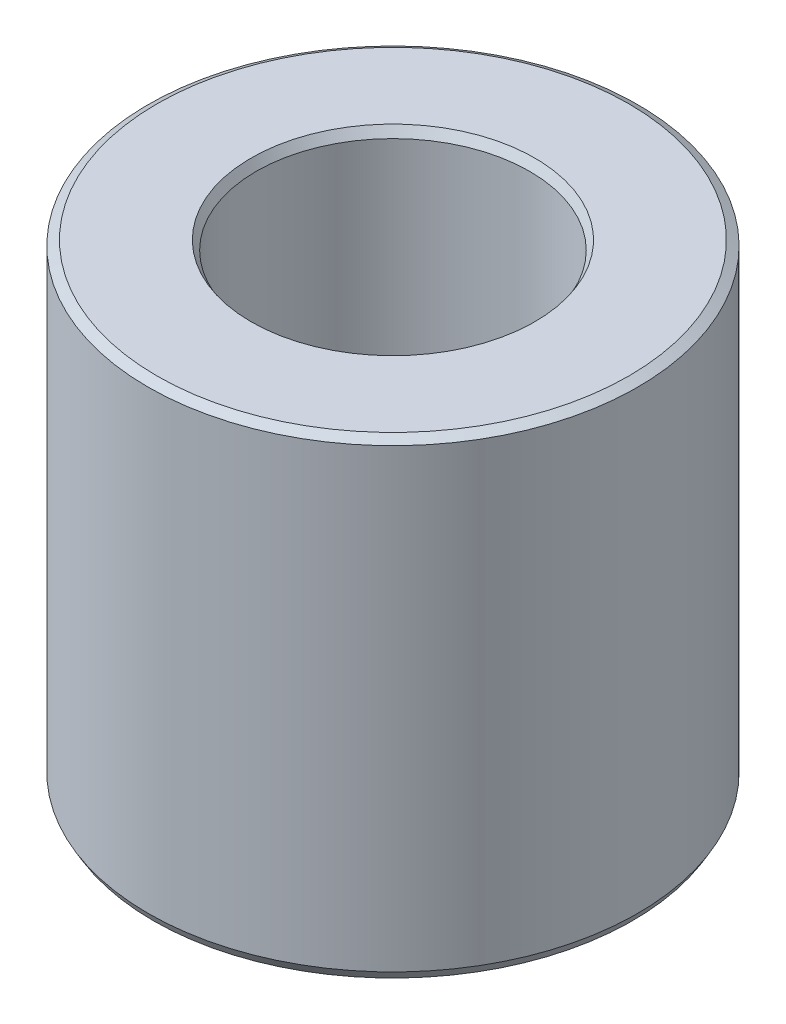
ISO-10303-21;
HEADER;
FILE_DESCRIPTION(('STEP AP214'),'2;1');
FILE_NAME('part.step','',(''),(''),'','','');
FILE_SCHEMA(('AUTOMOTIVE_DESIGN { 1 0 10303 214 1 1 1 1 }'));
ENDSEC;
DATA;
#1=APPLICATION_CONTEXT('core data for automotive mechanical design processes');
#2=APPLICATION_PROTOCOL_DEFINITION('international standard','automotive_design',2000,#1);
#3=PRODUCT_CONTEXT('',#1,'mechanical');
#4=PRODUCT('Part','Part','',(#3));
#5=PRODUCT_RELATED_PRODUCT_CATEGORY('part','',(#4));
#6=PRODUCT_DEFINITION_FORMATION('','',#4);
#7=PRODUCT_DEFINITION_CONTEXT('part definition',#1,'design');
#8=PRODUCT_DEFINITION('design','',#6,#7);
#9=PRODUCT_DEFINITION_SHAPE('','',#8);
#10=(LENGTH_UNIT() NAMED_UNIT(*) SI_UNIT(.MILLI.,.METRE.));
#11=(NAMED_UNIT(*) PLANE_ANGLE_UNIT() SI_UNIT($,.RADIAN.));
#12=(NAMED_UNIT(*) SI_UNIT($,.STERADIAN.) SOLID_ANGLE_UNIT());
#13=UNCERTAINTY_MEASURE_WITH_UNIT(LENGTH_MEASURE(1.E-05),#10,'distance_accuracy_value','');
#14=(GEOMETRIC_REPRESENTATION_CONTEXT(3) GLOBAL_UNCERTAINTY_ASSIGNED_CONTEXT((#13)) GLOBAL_UNIT_ASSIGNED_CONTEXT((#10,
#11,#12)) REPRESENTATION_CONTEXT('',''));
#15=CARTESIAN_POINT('',(0.,0.,0.));
#16=DIRECTION('',(0.,0.,1.));
#17=DIRECTION('',(1.,0.,0.));
#18=AXIS2_PLACEMENT_3D('',#15,#16,#17);
#19=CARTESIAN_POINT('',(0.,19.1954753413729,0.));
#20=DIRECTION('',(0.,-1.,0.));
#21=DIRECTION('',(0.,0.,-1.));
#22=AXIS2_PLACEMENT_3D('',#19,#20,#21);
#23=CYLINDRICAL_SURFACE('',#22,10.);
#24=CARTESIAN_POINT('',(0.,0.365051373205298,0.));
#25=DIRECTION('',(0.,1.,0.));
#26=DIRECTION('',(0.,0.,1.));
#27=AXIS2_PLACEMENT_3D('',#24,#25,#26);
#28=CIRCLE('',#27,10.);
#29=CARTESIAN_POINT('',(0.,0.365051373205298,10.));
#30=VERTEX_POINT('',#29);
#31=EDGE_CURVE('E10',#30,#30,#28,.T.);
#32=ORIENTED_EDGE('',*,*,#31,.T.);
#33=EDGE_LOOP('',(#32));
#34=FACE_BOUND('',#33,.T.);
#35=CARTESIAN_POINT('',(0.,18.9847128327847,0.));
#36=DIRECTION('',(0.,1.,0.));
#37=DIRECTION('',(0.,0.,1.));
#38=AXIS2_PLACEMENT_3D('',#35,#36,#37);
#39=CIRCLE('',#38,10.);
#40=CARTESIAN_POINT('',(0.,18.9847128327847,10.));
#41=VERTEX_POINT('',#40);
#42=EDGE_CURVE('E50',#41,#41,#39,.F.);
#43=ORIENTED_EDGE('',*,*,#42,.T.);
#44=EDGE_LOOP('',(#43));
#45=FACE_BOUND('',#44,.T.);
#46=ADVANCED_FACE('F39',(#34,#45),#23,.T.);
#47=CARTESIAN_POINT('',(0.,19.1954753413729,0.));
#48=DIRECTION('',(0.,1.,0.));
#49=DIRECTION('',(0.,0.,1.));
#50=AXIS2_PLACEMENT_3D('',#47,#48,#49);
#51=PLANE('',#50);
#52=CARTESIAN_POINT('',(0.,19.1954753413729,0.));
#53=DIRECTION('',(0.,1.,0.));
#54=DIRECTION('',(0.,0.,1.));
#55=AXIS2_PLACEMENT_3D('',#52,#53,#54);
#56=CIRCLE('',#55,5.79583039744094);
#57=CARTESIAN_POINT('',(0.,19.1954753413729,5.79583039744094));
#58=VERTEX_POINT('',#57);
#59=EDGE_CURVE('E58',#58,#58,#56,.F.);
#60=ORIENTED_EDGE('',*,*,#59,.T.);
#61=EDGE_LOOP('',(#60));
#62=FACE_BOUND('',#61,.T.);
#63=CARTESIAN_POINT('',(0.,19.1954753413729,0.));
#64=DIRECTION('',(0.,1.,0.));
#65=DIRECTION('',(0.,0.,1.));
#66=AXIS2_PLACEMENT_3D('',#63,#64,#65);
#67=CIRCLE('',#66,9.63494862679469);
#68=CARTESIAN_POINT('',(0.,19.1954753413729,9.63494862679469));
#69=VERTEX_POINT('',#68);
#70=EDGE_CURVE('E61',#69,#69,#67,.T.);
#71=ORIENTED_EDGE('',*,*,#70,.T.);
#72=EDGE_LOOP('',(#71));
#73=FACE_BOUND('',#72,.T.);
#74=ADVANCED_FACE('F88',(#62,#73),#51,.T.);
#75=CARTESIAN_POINT('',(0.,0.,0.));
#76=DIRECTION('',(0.,1.,0.));
#77=DIRECTION('',(0.,0.,1.));
#78=AXIS2_PLACEMENT_3D('',#75,#76,#77);
#79=PLANE('',#78);
#80=CARTESIAN_POINT('',(0.,0.,0.));
#81=DIRECTION('',(0.,1.,0.));
#82=DIRECTION('',(0.,0.,1.));
#83=AXIS2_PLACEMENT_3D('',#80,#81,#82);
#84=CIRCLE('',#83,5.95011926205811);
#85=CARTESIAN_POINT('',(0.,0.,5.95011926205811));
#86=VERTEX_POINT('',#85);
#87=EDGE_CURVE('E51',#86,#86,#84,.T.);
#88=ORIENTED_EDGE('',*,*,#87,.T.);
#89=EDGE_LOOP('',(#88));
#90=FACE_BOUND('',#89,.T.);
#91=CARTESIAN_POINT('',(0.,0.,0.));
#92=DIRECTION('',(0.,1.,0.));
#93=DIRECTION('',(0.,0.,1.));
#94=AXIS2_PLACEMENT_3D('',#91,#92,#93);
#95=CIRCLE('',#94,9.78923749141188);
#96=CARTESIAN_POINT('',(0.,0.,9.78923749141188));
#97=VERTEX_POINT('',#96);
#98=EDGE_CURVE('E54',#97,#97,#95,.F.);
#99=ORIENTED_EDGE('',*,*,#98,.T.);
#100=EDGE_LOOP('',(#99));
#101=FACE_BOUND('',#100,.T.);
#102=ADVANCED_FACE('F83',(#90,#101),#79,.F.);
#103=CARTESIAN_POINT('',(0.,19.1954753413729,0.));
#104=DIRECTION('',(0.,-1.,0.));
#105=DIRECTION('',(0.,0.,-1.));
#106=AXIS2_PLACEMENT_3D('',#103,#104,#105);
#107=CYLINDRICAL_SURFACE('',#106,5.58506788885281);
#108=CARTESIAN_POINT('',(0.,18.8304239681676,0.));
#109=DIRECTION('',(0.,1.,0.));
#110=DIRECTION('',(0.,0.,1.));
#111=AXIS2_PLACEMENT_3D('',#108,#109,#110);
#112=CIRCLE('',#111,5.58506788885281);
#113=CARTESIAN_POINT('',(0.,18.8304239681676,5.58506788885281));
#114=VERTEX_POINT('',#113);
#115=EDGE_CURVE('E67',#114,#114,#112,.T.);
#116=ORIENTED_EDGE('',*,*,#115,.T.);
#117=EDGE_LOOP('',(#116));
#118=FACE_BOUND('',#117,.T.);
#119=CARTESIAN_POINT('',(0.,0.21076250858813,0.));
#120=DIRECTION('',(0.,1.,0.));
#121=DIRECTION('',(0.,0.,1.));
#122=AXIS2_PLACEMENT_3D('',#119,#120,#121);
#123=CIRCLE('',#122,5.58506788885281);
#124=CARTESIAN_POINT('',(0.,0.21076250858813,5.58506788885281));
#125=VERTEX_POINT('',#124);
#126=EDGE_CURVE('E69',#125,#125,#123,.F.);
#127=ORIENTED_EDGE('',*,*,#126,.T.);
#128=EDGE_LOOP('',(#127));
#129=FACE_BOUND('',#128,.T.);
#130=ADVANCED_FACE('F71',(#118,#129),#107,.F.);
#131=CARTESIAN_POINT('',(0.,18.8304239681676,0.));
#132=DIRECTION('',(0.,1.,0.));
#133=DIRECTION('',(0.,0.,1.));
#134=AXIS2_PLACEMENT_3D('',#131,#132,#133);
#135=CONICAL_SURFACE('',#134,5.58506788885281,0.5235987755983);
#136=ORIENTED_EDGE('',*,*,#59,.F.);
#137=EDGE_LOOP('',(#136));
#138=FACE_BOUND('',#137,.T.);
#139=ORIENTED_EDGE('',*,*,#115,.F.);
#140=EDGE_LOOP('',(#139));
#141=FACE_BOUND('',#140,.T.);
#142=ADVANCED_FACE('F77',(#138,#141),#135,.F.);
#143=CARTESIAN_POINT('',(0.,0.,0.));
#144=DIRECTION('',(0.,-1.,0.));
#145=DIRECTION('',(0.,0.,-1.));
#146=AXIS2_PLACEMENT_3D('',#143,#144,#145);
#147=CONICAL_SURFACE('',#146,5.95011926205811,1.04719755119659);
#148=ORIENTED_EDGE('',*,*,#126,.F.);
#149=EDGE_LOOP('',(#148));
#150=FACE_BOUND('',#149,.T.);
#151=ORIENTED_EDGE('',*,*,#87,.F.);
#152=EDGE_LOOP('',(#151));
#153=FACE_BOUND('',#152,.T.);
#154=ADVANCED_FACE('F73',(#150,#153),#147,.F.);
#155=CARTESIAN_POINT('',(0.,0.365051373205298,0.));
#156=DIRECTION('',(0.,1.,0.));
#157=DIRECTION('',(0.,0.,1.));
#158=AXIS2_PLACEMENT_3D('',#155,#156,#157);
#159=CONICAL_SURFACE('',#158,10.,0.523598775598301);
#160=ORIENTED_EDGE('',*,*,#98,.F.);
#161=EDGE_LOOP('',(#160));
#162=FACE_BOUND('',#161,.T.);
#163=ORIENTED_EDGE('',*,*,#31,.F.);
#164=EDGE_LOOP('',(#163));
#165=FACE_BOUND('',#164,.T.);
#166=ADVANCED_FACE('F76',(#162,#165),#159,.T.);
#167=CARTESIAN_POINT('',(0.,19.1954753413729,0.));
#168=DIRECTION('',(0.,-1.,0.));
#169=DIRECTION('',(0.,0.,-1.));
#170=AXIS2_PLACEMENT_3D('',#167,#168,#169);
#171=CONICAL_SURFACE('',#170,9.63494862679469,1.0471975511966);
#172=ORIENTED_EDGE('',*,*,#42,.F.);
#173=EDGE_LOOP('',(#172));
#174=FACE_BOUND('',#173,.T.);
#175=ORIENTED_EDGE('',*,*,#70,.F.);
#176=EDGE_LOOP('',(#175));
#177=FACE_BOUND('',#176,.T.);
#178=ADVANCED_FACE('F45',(#174,#177),#171,.T.);
#179=CLOSED_SHELL('',(#46,#74,#102,#130,#142,#154,#166,#178));
#180=MANIFOLD_SOLID_BREP('B2',#179);
#181=ADVANCED_BREP_SHAPE_REPRESENTATION('',(#18,#180),#14);
#182=SHAPE_DEFINITION_REPRESENTATION(#9,#181);
ENDSEC;
END-ISO-10303-21;
